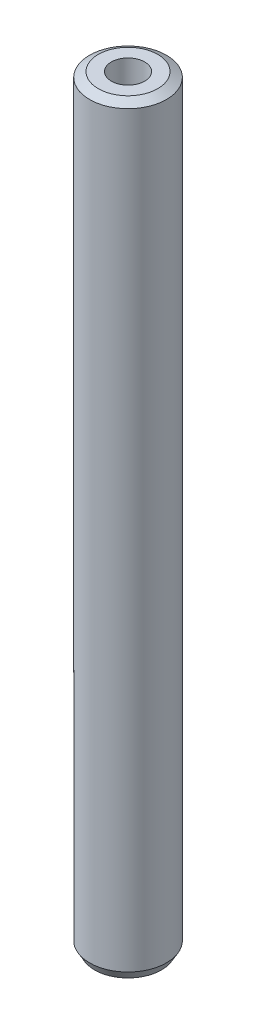
ISO-10303-21;
HEADER;
FILE_DESCRIPTION(('STEP AP214'),'2;1');
FILE_NAME('part.step','',(''),(''),'','','');
FILE_SCHEMA(('AUTOMOTIVE_DESIGN { 1 0 10303 214 1 1 1 1 }'));
ENDSEC;
DATA;
#1=APPLICATION_CONTEXT('core data for automotive mechanical design processes');
#2=APPLICATION_PROTOCOL_DEFINITION('international standard','automotive_design',2000,#1);
#3=PRODUCT_CONTEXT('',#1,'mechanical');
#4=PRODUCT('Part','Part','',(#3));
#5=PRODUCT_RELATED_PRODUCT_CATEGORY('part','',(#4));
#6=PRODUCT_DEFINITION_FORMATION('','',#4);
#7=PRODUCT_DEFINITION_CONTEXT('part definition',#1,'design');
#8=PRODUCT_DEFINITION('design','',#6,#7);
#9=PRODUCT_DEFINITION_SHAPE('','',#8);
#10=(LENGTH_UNIT() NAMED_UNIT(*) SI_UNIT(.MILLI.,.METRE.));
#11=(NAMED_UNIT(*) PLANE_ANGLE_UNIT() SI_UNIT($,.RADIAN.));
#12=(NAMED_UNIT(*) SI_UNIT($,.STERADIAN.) SOLID_ANGLE_UNIT());
#13=UNCERTAINTY_MEASURE_WITH_UNIT(LENGTH_MEASURE(1.E-05),#10,'distance_accuracy_value','');
#14=(GEOMETRIC_REPRESENTATION_CONTEXT(3) GLOBAL_UNCERTAINTY_ASSIGNED_CONTEXT((#13)) GLOBAL_UNIT_ASSIGNED_CONTEXT((#10,
#11,#12)) REPRESENTATION_CONTEXT('',''));
#15=CARTESIAN_POINT('',(0.,0.,0.));
#16=DIRECTION('',(0.,0.,1.));
#17=DIRECTION('',(1.,0.,0.));
#18=AXIS2_PLACEMENT_3D('',#15,#16,#17);
#19=CARTESIAN_POINT('',(0.,396.282376927199,0.));
#20=DIRECTION('',(0.,-1.,0.));
#21=DIRECTION('',(0.,0.,-1.));
#22=AXIS2_PLACEMENT_3D('',#19,#20,#21);
#23=CYLINDRICAL_SURFACE('',#22,20.);
#24=CARTESIAN_POINT('',(0.,393.665992112977,0.));
#25=DIRECTION('',(0.,1.,0.));
#26=DIRECTION('',(0.,0.,1.));
#27=AXIS2_PLACEMENT_3D('',#24,#25,#26);
#28=CIRCLE('',#27,20.);
#29=CARTESIAN_POINT('',(0.,393.665992112977,-20.));
#30=VERTEX_POINT('',#29);
#31=EDGE_CURVE('E50',#30,#30,#28,.F.);
#32=CARTESIAN_POINT('',(0.,4.53171143038411,0.));
#33=DIRECTION('',(0.,1.,0.));
#34=DIRECTION('',(0.,0.,1.));
#35=AXIS2_PLACEMENT_3D('',#32,#33,#34);
#36=CIRCLE('',#35,20.);
#37=CARTESIAN_POINT('',(0.,4.53171143038406,-20.));
#38=VERTEX_POINT('',#37);
#39=EDGE_CURVE('E51',#38,#38,#36,.T.);
#40=CARTESIAN_POINT('',(0.,393.665992112977,-20.));
#41=CARTESIAN_POINT('',(0.,389.612510022534,-20.));
#42=CARTESIAN_POINT('',(0.,385.55902793209,-20.));
#43=CARTESIAN_POINT('',(0.,377.452063751203,-20.));
#44=CARTESIAN_POINT('',(0.,373.398581660759,-20.));
#45=CARTESIAN_POINT('',(0.,365.291617479872,-20.));
#46=CARTESIAN_POINT('',(0.,361.238135389428,-20.));
#47=CARTESIAN_POINT('',(0.,353.131171208541,-20.));
#48=CARTESIAN_POINT('',(0.,349.077689118097,-20.));
#49=CARTESIAN_POINT('',(0.,340.97072493721,-20.));
#50=CARTESIAN_POINT('',(0.,336.917242846766,-20.));
#51=CARTESIAN_POINT('',(0.,328.810278665878,-20.));
#52=CARTESIAN_POINT('',(0.,324.756796575435,-20.));
#53=CARTESIAN_POINT('',(0.,316.649832394547,-20.));
#54=CARTESIAN_POINT('',(0.,312.596350304104,-20.));
#55=CARTESIAN_POINT('',(0.,304.489386123216,-20.));
#56=CARTESIAN_POINT('',(0.,300.435904032773,-20.));
#57=CARTESIAN_POINT('',(0.,292.328939851885,-20.));
#58=CARTESIAN_POINT('',(0.,288.275457761442,-20.));
#59=CARTESIAN_POINT('',(0.,280.168493580554,-20.));
#60=CARTESIAN_POINT('',(0.,276.115011490111,-20.));
#61=CARTESIAN_POINT('',(0.,268.008047309223,-20.));
#62=CARTESIAN_POINT('',(0.,263.95456521878,-20.));
#63=CARTESIAN_POINT('',(0.,255.847601037892,-20.));
#64=CARTESIAN_POINT('',(0.,251.794118947449,-20.));
#65=CARTESIAN_POINT('',(0.,243.687154766561,-20.));
#66=CARTESIAN_POINT('',(0.,239.633672676118,-20.));
#67=CARTESIAN_POINT('',(0.,231.52670849523,-20.));
#68=CARTESIAN_POINT('',(0.,227.473226404786,-20.));
#69=CARTESIAN_POINT('',(0.,219.366262223899,-20.));
#70=CARTESIAN_POINT('',(0.,215.312780133455,-20.));
#71=CARTESIAN_POINT('',(0.,207.205815952568,-20.));
#72=CARTESIAN_POINT('',(0.,203.152333862124,-20.));
#73=CARTESIAN_POINT('',(0.,195.045369681237,-20.));
#74=CARTESIAN_POINT('',(0.,190.991887590793,-20.));
#75=CARTESIAN_POINT('',(0.,182.884923409906,-20.));
#76=CARTESIAN_POINT('',(0.,178.831441319462,-20.));
#77=CARTESIAN_POINT('',(0.,170.724477138575,-20.));
#78=CARTESIAN_POINT('',(0.,166.670995048131,-20.));
#79=CARTESIAN_POINT('',(0.,158.564030867244,-20.));
#80=CARTESIAN_POINT('',(0.,154.5105487768,-20.));
#81=CARTESIAN_POINT('',(0.,146.403584595913,-20.));
#82=CARTESIAN_POINT('',(0.,142.350102505469,-20.));
#83=CARTESIAN_POINT('',(0.,134.243138324582,-20.));
#84=CARTESIAN_POINT('',(0.,130.189656234138,-20.));
#85=CARTESIAN_POINT('',(0.,122.082692053251,-20.));
#86=CARTESIAN_POINT('',(0.,118.029209962807,-20.));
#87=CARTESIAN_POINT('',(0.,109.92224578192,-20.));
#88=CARTESIAN_POINT('',(0.,105.868763691476,-20.));
#89=CARTESIAN_POINT('',(0.,97.7617995105887,-20.));
#90=CARTESIAN_POINT('',(0.,93.708317420145,-20.));
#91=CARTESIAN_POINT('',(0.,85.6013532392577,-20.));
#92=CARTESIAN_POINT('',(0.,81.547871148814,-20.));
#93=CARTESIAN_POINT('',(0.,73.4409069679266,-20.));
#94=CARTESIAN_POINT('',(0.,69.3874248774829,-20.));
#95=CARTESIAN_POINT('',(0.,61.2804606965956,-20.));
#96=CARTESIAN_POINT('',(0.,57.2269786061519,-20.));
#97=CARTESIAN_POINT('',(0.,49.1200144252646,-20.));
#98=CARTESIAN_POINT('',(0.,45.0665323348209,-20.));
#99=CARTESIAN_POINT('',(0.,36.9595681539335,-20.));
#100=CARTESIAN_POINT('',(0.,32.9060860634898,-20.));
#101=CARTESIAN_POINT('',(0.,24.7991218826025,-20.));
#102=CARTESIAN_POINT('',(0.,20.7456397921588,-20.));
#103=CARTESIAN_POINT('',(0.,12.6386756112714,-20.));
#104=CARTESIAN_POINT('',(0.,8.58519352082774,-20.));
#105=CARTESIAN_POINT('',(0.,4.53171143038406,-20.));
#106=B_SPLINE_CURVE_WITH_KNOTS('',3,(#40,#41,#42,#43,#44,#45,#46,#47,#48,#49,#50,#51,#52,#53,
#54,#55,#56,#57,#58,#59,#60,#61,#62,#63,#64,#65,#66,#67,#68,#69,#70,#71,#72,#73,#74,#75,#76,#77,
#78,#79,#80,#81,#82,#83,#84,#85,#86,#87,#88,#89,#90,#91,#92,#93,#94,#95,#96,#97,#98,#99,#100,
#101,#102,#103,#104,#105),.UNSPECIFIED.,.F.,.F.,(4,2,2,2,2,2,2,2,2,2,2,2,2,2,2,2,2,2,2,2,2,2,2,
2,2,2,2,2,2,2,2,2,4),(0.,12.160446271331,24.3208925426621,36.4813388139931,48.6417850853241,
60.8022313566551,72.9626776279862,85.1231238993172,97.2835701706483,109.444016441979,
121.60446271331,133.764908984641,145.925355255972,158.085801527303,170.246247798634,
182.406694069966,194.567140341297,206.727586612628,218.888032883959,231.04847915529,
243.208925426621,255.369371697952,267.529817969283,279.690264240614,291.850710511945,
304.011156783276,316.171603054607,328.332049325938,340.492495597269,352.6529418686,
364.813388139931,376.973834411262,389.134280682593),.UNSPECIFIED.);
#107=EDGE_CURVE('BSEAM39',#30,#38,#106,.T.);
#108=ORIENTED_EDGE('',*,*,#31,.T.);
#109=ORIENTED_EDGE('',*,*,#39,.T.);
#110=ORIENTED_EDGE('',*,*,#107,.T.);
#111=ORIENTED_EDGE('',*,*,#107,.F.);
#112=EDGE_LOOP('',(#108,#110,#109,#111));
#113=FACE_BOUND('',#112,.T.);
#114=ADVANCED_FACE('F39',(#113),#23,.T.);
#115=CARTESIAN_POINT('',(0.,396.282376927199,0.));
#116=DIRECTION('',(0.,1.,0.));
#117=DIRECTION('',(0.,0.,1.));
#118=AXIS2_PLACEMENT_3D('',#115,#116,#117);
#119=PLANE('',#118);
#120=CARTESIAN_POINT('',(0.,396.282376927199,0.));
#121=DIRECTION('',(0.,1.,0.));
#122=DIRECTION('',(0.,0.,1.));
#123=AXIS2_PLACEMENT_3D('',#120,#121,#122);
#124=CIRCLE('',#123,15.4682885696166);
#125=CARTESIAN_POINT('',(0.,396.282376927199,15.4682885696166));
#126=VERTEX_POINT('',#125);
#127=EDGE_CURVE('E54',#126,#126,#124,.T.);
#128=ORIENTED_EDGE('',*,*,#127,.T.);
#129=EDGE_LOOP('',(#128));
#130=FACE_BOUND('',#129,.T.);
#131=CARTESIAN_POINT('',(0.,396.282376927199,0.));
#132=DIRECTION('',(0.,1.,0.));
#133=DIRECTION('',(0.,0.,1.));
#134=AXIS2_PLACEMENT_3D('',#131,#132,#133);
#135=CIRCLE('',#134,8.67489629630612);
#136=CARTESIAN_POINT('',(0.,396.282376927199,-8.67489629630612));
#137=VERTEX_POINT('',#136);
#138=EDGE_CURVE('E58',#137,#137,#135,.T.);
#139=ORIENTED_EDGE('',*,*,#138,.F.);
#140=EDGE_LOOP('',(#139));
#141=FACE_BOUND('',#140,.T.);
#142=ADVANCED_FACE('F69',(#130,#141),#119,.T.);
#143=CARTESIAN_POINT('',(0.,0.,0.));
#144=DIRECTION('',(0.,1.,0.));
#145=DIRECTION('',(0.,0.,1.));
#146=AXIS2_PLACEMENT_3D('',#143,#144,#145);
#147=PLANE('',#146);
#148=CARTESIAN_POINT('',(0.,0.,0.));
#149=DIRECTION('',(0.,1.,0.));
#150=DIRECTION('',(0.,0.,1.));
#151=AXIS2_PLACEMENT_3D('',#148,#149,#150);
#152=CIRCLE('',#151,17.383615185778);
#153=CARTESIAN_POINT('',(0.,0.,17.383615185778));
#154=VERTEX_POINT('',#153);
#155=EDGE_CURVE('E10',#154,#154,#152,.F.);
#156=ORIENTED_EDGE('',*,*,#155,.T.);
#157=EDGE_LOOP('',(#156));
#158=FACE_BOUND('',#157,.T.);
#159=CARTESIAN_POINT('',(0.,0.,0.));
#160=DIRECTION('',(0.,1.,0.));
#161=DIRECTION('',(0.,0.,1.));
#162=AXIS2_PLACEMENT_3D('',#159,#160,#161);
#163=CIRCLE('',#162,8.67489629630612);
#164=CARTESIAN_POINT('',(0.,0.,-8.67489629630612));
#165=VERTEX_POINT('',#164);
#166=EDGE_CURVE('E63',#165,#165,#163,.T.);
#167=ORIENTED_EDGE('',*,*,#166,.T.);
#168=EDGE_LOOP('',(#167));
#169=FACE_BOUND('',#168,.T.);
#170=ADVANCED_FACE('F75',(#158,#169),#147,.F.);
#171=CARTESIAN_POINT('',(0.,396.282376927199,0.));
#172=DIRECTION('',(0.,-1.,0.));
#173=DIRECTION('',(0.,0.,-1.));
#174=AXIS2_PLACEMENT_3D('',#171,#172,#173);
#175=CYLINDRICAL_SURFACE('',#174,8.67489629630612);
#176=CARTESIAN_POINT('',(0.,396.282376927199,-8.67489629630612));
#177=CARTESIAN_POINT('',(0.,392.154435500874,-8.67489629630612));
#178=CARTESIAN_POINT('',(0.,388.026494074549,-8.67489629630612));
#179=CARTESIAN_POINT('',(0.,379.770611221899,-8.67489629630612));
#180=CARTESIAN_POINT('',(0.,375.642669795574,-8.67489629630612));
#181=CARTESIAN_POINT('',(0.,367.386786942924,-8.67489629630612));
#182=CARTESIAN_POINT('',(0.,363.258845516599,-8.67489629630612));
#183=CARTESIAN_POINT('',(0.,355.002962663949,-8.67489629630612));
#184=CARTESIAN_POINT('',(0.,350.875021237624,-8.67489629630612));
#185=CARTESIAN_POINT('',(0.,342.619138384974,-8.67489629630612));
#186=CARTESIAN_POINT('',(0.,338.491196958649,-8.67489629630612));
#187=CARTESIAN_POINT('',(0.,330.235314105999,-8.67489629630612));
#188=CARTESIAN_POINT('',(0.,326.107372679674,-8.67489629630612));
#189=CARTESIAN_POINT('',(0.,317.851489827024,-8.67489629630612));
#190=CARTESIAN_POINT('',(0.,313.723548400699,-8.67489629630612));
#191=CARTESIAN_POINT('',(0.,305.467665548049,-8.67489629630612));
#192=CARTESIAN_POINT('',(0.,301.339724121724,-8.67489629630612));
#193=CARTESIAN_POINT('',(0.,293.083841269074,-8.67489629630612));
#194=CARTESIAN_POINT('',(0.,288.955899842749,-8.67489629630612));
#195=CARTESIAN_POINT('',(0.,280.700016990099,-8.67489629630612));
#196=CARTESIAN_POINT('',(0.,276.572075563774,-8.67489629630612));
#197=CARTESIAN_POINT('',(0.,268.316192711124,-8.67489629630612));
#198=CARTESIAN_POINT('',(0.,264.188251284799,-8.67489629630612));
#199=CARTESIAN_POINT('',(0.,255.932368432149,-8.67489629630612));
#200=CARTESIAN_POINT('',(0.,251.804427005824,-8.67489629630612));
#201=CARTESIAN_POINT('',(0.,243.548544153174,-8.67489629630612));
#202=CARTESIAN_POINT('',(0.,239.420602726849,-8.67489629630612));
#203=CARTESIAN_POINT('',(0.,231.164719874199,-8.67489629630612));
#204=CARTESIAN_POINT('',(0.,227.036778447874,-8.67489629630612));
#205=CARTESIAN_POINT('',(0.,218.780895595224,-8.67489629630612));
#206=CARTESIAN_POINT('',(0.,214.652954168899,-8.67489629630612));
#207=CARTESIAN_POINT('',(0.,206.397071316249,-8.67489629630612));
#208=CARTESIAN_POINT('',(0.,202.269129889924,-8.67489629630612));
#209=CARTESIAN_POINT('',(0.,194.013247037274,-8.67489629630612));
#210=CARTESIAN_POINT('',(0.,189.885305610949,-8.67489629630612));
#211=CARTESIAN_POINT('',(0.,181.629422758299,-8.67489629630612));
#212=CARTESIAN_POINT('',(0.,177.501481331975,-8.67489629630612));
#213=CARTESIAN_POINT('',(0.,169.245598479324,-8.67489629630612));
#214=CARTESIAN_POINT('',(0.,165.117657053,-8.67489629630612));
#215=CARTESIAN_POINT('',(0.,156.86177420035,-8.67489629630612));
#216=CARTESIAN_POINT('',(0.,152.733832774025,-8.67489629630612));
#217=CARTESIAN_POINT('',(0.,144.477949921375,-8.67489629630612));
#218=CARTESIAN_POINT('',(0.,140.35000849505,-8.67489629630612));
#219=CARTESIAN_POINT('',(0.,132.0941256424,-8.67489629630612));
#220=CARTESIAN_POINT('',(0.,127.966184216075,-8.67489629630612));
#221=CARTESIAN_POINT('',(0.,119.710301363425,-8.67489629630612));
#222=CARTESIAN_POINT('',(0.,115.5823599371,-8.67489629630612));
#223=CARTESIAN_POINT('',(0.,107.32647708445,-8.67489629630612));
#224=CARTESIAN_POINT('',(0.,103.198535658125,-8.67489629630612));
#225=CARTESIAN_POINT('',(0.,94.9426528054747,-8.67489629630612));
#226=CARTESIAN_POINT('',(0.,90.8147113791497,-8.67489629630612));
#227=CARTESIAN_POINT('',(0.,82.5588285264997,-8.67489629630612));
#228=CARTESIAN_POINT('',(0.,78.4308871001747,-8.67489629630612));
#229=CARTESIAN_POINT('',(0.,70.1750042475248,-8.67489629630612));
#230=CARTESIAN_POINT('',(0.,66.0470628211998,-8.67489629630612));
#231=CARTESIAN_POINT('',(0.,57.7911799685498,-8.67489629630612));
#232=CARTESIAN_POINT('',(0.,53.6632385422248,-8.67489629630612));
#233=CARTESIAN_POINT('',(0.,45.4073556895748,-8.67489629630612));
#234=CARTESIAN_POINT('',(0.,41.2794142632498,-8.67489629630612));
#235=CARTESIAN_POINT('',(0.,33.0235314105998,-8.67489629630612));
#236=CARTESIAN_POINT('',(0.,28.8955899842749,-8.67489629630612));
#237=CARTESIAN_POINT('',(0.,20.6397071316249,-8.67489629630612));
#238=CARTESIAN_POINT('',(0.,16.5117657052999,-8.67489629630612));
#239=CARTESIAN_POINT('',(0.,8.2558828526499,-8.67489629630612));
#240=CARTESIAN_POINT('',(0.,4.12794142632492,-8.67489629630612));
#241=CARTESIAN_POINT('',(0.,0.,-8.67489629630612));
#242=B_SPLINE_CURVE_WITH_KNOTS('',3,(#176,#177,#178,#179,#180,#181,#182,#183,#184,#185,#186,
#187,#188,#189,#190,#191,#192,#193,#194,#195,#196,#197,#198,#199,#200,#201,#202,#203,#204,#205,
#206,#207,#208,#209,#210,#211,#212,#213,#214,#215,#216,#217,#218,#219,#220,#221,#222,#223,#224,
#225,#226,#227,#228,#229,#230,#231,#232,#233,#234,#235,#236,#237,#238,#239,#240,#241),
.UNSPECIFIED.,.F.,.F.,(4,2,2,2,2,2,2,2,2,2,2,2,2,2,2,2,2,2,2,2,2,2,2,2,2,2,2,2,2,2,2,2,4),(0.,
12.3838242789749,24.7676485579499,37.1514728369249,49.5352971158998,61.9191213948748,
74.3029456738498,86.6867699528247,99.0705942317997,111.454418510775,123.83824278975,
136.222067068725,148.6058913477,160.989715626675,173.373539905649,185.757364184624,
198.141188463599,210.525012742574,222.908837021549,235.292661300524,247.676485579499,
260.060309858474,272.444134137449,284.827958416424,297.211782695399,309.595606974374,
321.979431253349,334.363255532324,346.747079811299,359.130904090274,371.514728369249,
383.898552648224,396.282376927199),.UNSPECIFIED.);
#243=EDGE_CURVE('BSEAM70',#137,#165,#242,.T.);
#244=ORIENTED_EDGE('',*,*,#138,.T.);
#245=ORIENTED_EDGE('',*,*,#166,.F.);
#246=ORIENTED_EDGE('',*,*,#243,.T.);
#247=ORIENTED_EDGE('',*,*,#243,.F.);
#248=EDGE_LOOP('',(#244,#246,#245,#247));
#249=FACE_BOUND('',#248,.T.);
#250=ADVANCED_FACE('F70',(#249),#175,.F.);
#251=CARTESIAN_POINT('',(0.,396.282376927199,0.));
#252=DIRECTION('',(0.,-1.,0.));
#253=DIRECTION('',(0.,0.,-1.));
#254=AXIS2_PLACEMENT_3D('',#251,#252,#253);
#255=CONICAL_SURFACE('',#254,15.4682885696166,1.0471975511966);
#256=ORIENTED_EDGE('',*,*,#31,.F.);
#257=EDGE_LOOP('',(#256));
#258=FACE_BOUND('',#257,.T.);
#259=ORIENTED_EDGE('',*,*,#127,.F.);
#260=EDGE_LOOP('',(#259));
#261=FACE_BOUND('',#260,.T.);
#262=ADVANCED_FACE('F81',(#258,#261),#255,.T.);
#263=CARTESIAN_POINT('',(0.,4.53171143038411,0.));
#264=DIRECTION('',(0.,1.,0.));
#265=DIRECTION('',(0.,0.,1.));
#266=AXIS2_PLACEMENT_3D('',#263,#264,#265);
#267=CONICAL_SURFACE('',#266,20.,0.523598775598301);
#268=ORIENTED_EDGE('',*,*,#155,.F.);
#269=EDGE_LOOP('',(#268));
#270=FACE_BOUND('',#269,.T.);
#271=ORIENTED_EDGE('',*,*,#39,.F.);
#272=EDGE_LOOP('',(#271));
#273=FACE_BOUND('',#272,.T.);
#274=ADVANCED_FACE('F45',(#270,#273),#267,.T.);
#275=CLOSED_SHELL('',(#114,#142,#170,#250,#262,#274));
#276=MANIFOLD_SOLID_BREP('B2',#275);
#277=ADVANCED_BREP_SHAPE_REPRESENTATION('',(#18,#276),#14);
#278=SHAPE_DEFINITION_REPRESENTATION(#9,#277);
ENDSEC;
END-ISO-10303-21;
